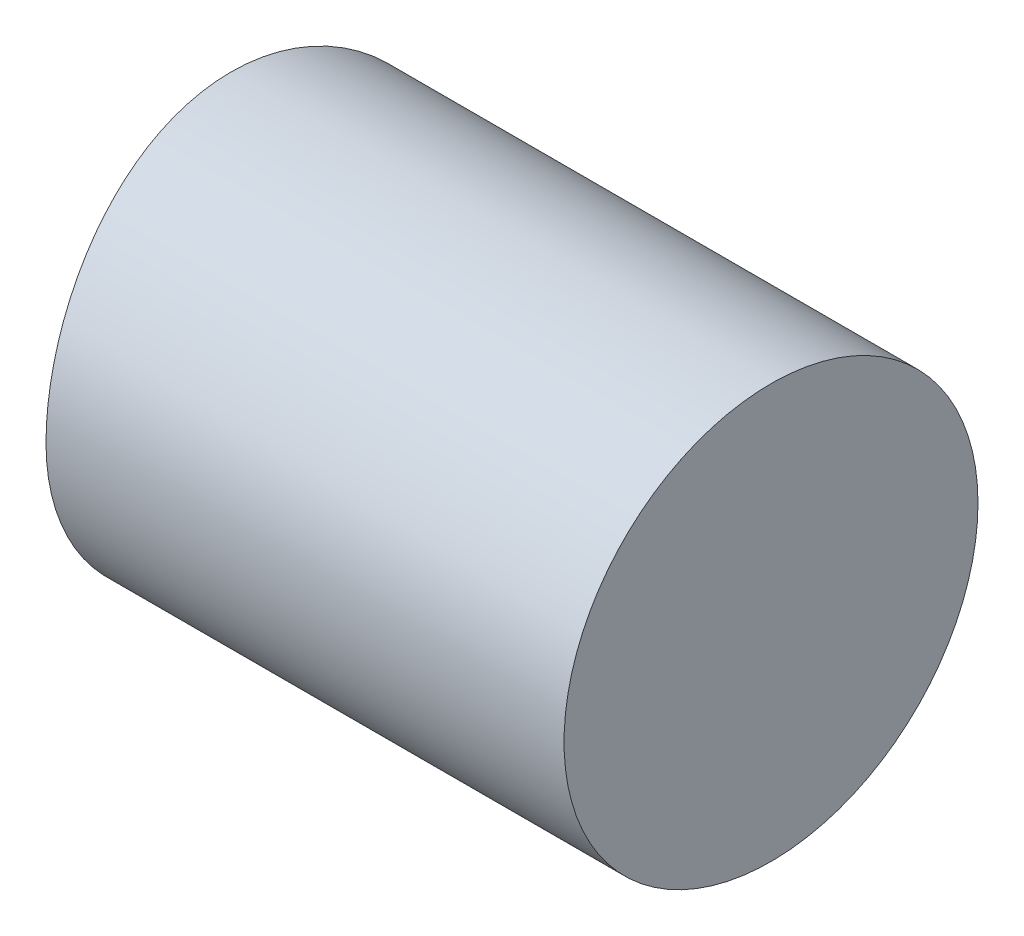
ISO-10303-21;
HEADER;
FILE_DESCRIPTION(('STEP AP214'),'2;1');
FILE_NAME('part.step','',(''),(''),'','','');
FILE_SCHEMA(('AUTOMOTIVE_DESIGN { 1 0 10303 214 1 1 1 1 }'));
ENDSEC;
DATA;
#1=APPLICATION_CONTEXT('core data for automotive mechanical design processes');
#2=APPLICATION_PROTOCOL_DEFINITION('international standard','automotive_design',2000,#1);
#3=PRODUCT_CONTEXT('',#1,'mechanical');
#4=PRODUCT('Part','Part','',(#3));
#5=PRODUCT_RELATED_PRODUCT_CATEGORY('part','',(#4));
#6=PRODUCT_DEFINITION_FORMATION('','',#4);
#7=PRODUCT_DEFINITION_CONTEXT('part definition',#1,'design');
#8=PRODUCT_DEFINITION('design','',#6,#7);
#9=PRODUCT_DEFINITION_SHAPE('','',#8);
#10=(LENGTH_UNIT() NAMED_UNIT(*) SI_UNIT(.MILLI.,.METRE.));
#11=(NAMED_UNIT(*) PLANE_ANGLE_UNIT() SI_UNIT($,.RADIAN.));
#12=(NAMED_UNIT(*) SI_UNIT($,.STERADIAN.) SOLID_ANGLE_UNIT());
#13=UNCERTAINTY_MEASURE_WITH_UNIT(LENGTH_MEASURE(1.E-05),#10,'distance_accuracy_value','');
#14=(GEOMETRIC_REPRESENTATION_CONTEXT(3) GLOBAL_UNCERTAINTY_ASSIGNED_CONTEXT((#13)) GLOBAL_UNIT_ASSIGNED_CONTEXT((#10,
#11,#12)) REPRESENTATION_CONTEXT('',''));
#15=CARTESIAN_POINT('',(0.,0.,0.));
#16=DIRECTION('',(0.,0.,1.));
#17=DIRECTION('',(1.,0.,0.));
#18=AXIS2_PLACEMENT_3D('',#15,#16,#17);
#19=CARTESIAN_POINT('',(7.62,0.,0.));
#20=DIRECTION('',(-1.,0.,0.));
#21=DIRECTION('',(0.,0.,1.));
#22=AXIS2_PLACEMENT_3D('',#19,#20,#21);
#23=CYLINDRICAL_SURFACE('',#22,2.921);
#24=DIRECTION('',(-1.,0.,0.));
#25=VECTOR('',#24,1.);
#26=CARTESIAN_POINT('',(7.62,-1.96747553987337,-2.159));
#27=LINE('',#26,#25);
#28=CARTESIAN_POINT('',(4.37278998770607,-1.96747553987337,-2.159));
#29=VERTEX_POINT('',#28);
#30=CARTESIAN_POINT('',(2.84878998770607,-1.96747553987337,-2.159));
#31=VERTEX_POINT('',#30);
#32=EDGE_CURVE('E79',#29,#31,#27,.T.);
#33=ORIENTED_EDGE('',*,*,#32,.F.);
#34=CARTESIAN_POINT('',(4.37278998770607,0.,0.));
#35=DIRECTION('',(1.,0.,0.));
#36=DIRECTION('',(0.,0.,-1.));
#37=AXIS2_PLACEMENT_3D('',#34,#35,#36);
#38=CIRCLE('',#37,2.921);
#39=CARTESIAN_POINT('',(4.37278998770607,1.96747553987337,-2.159));
#40=VERTEX_POINT('',#39);
#41=EDGE_CURVE('E88',#40,#29,#38,.F.);
#42=ORIENTED_EDGE('',*,*,#41,.F.);
#43=DIRECTION('',(-1.,0.,0.));
#44=VECTOR('',#43,1.);
#45=CARTESIAN_POINT('',(7.62,1.96747553987337,-2.159));
#46=LINE('',#45,#44);
#47=CARTESIAN_POINT('',(2.84878998770607,1.96747553987337,-2.159));
#48=VERTEX_POINT('',#47);
#49=EDGE_CURVE('E76',#40,#48,#46,.T.);
#50=ORIENTED_EDGE('',*,*,#49,.T.);
#51=CARTESIAN_POINT('',(2.84878998770607,0.,0.));
#52=DIRECTION('',(-1.,0.,0.));
#53=DIRECTION('',(0.,0.,1.));
#54=AXIS2_PLACEMENT_3D('',#51,#52,#53);
#55=CIRCLE('',#54,2.921);
#56=EDGE_CURVE('E84',#31,#48,#55,.F.);
#57=ORIENTED_EDGE('',*,*,#56,.F.);
#58=EDGE_LOOP('',(#33,#42,#50,#57));
#59=FACE_BOUND('',#58,.T.);
#60=CARTESIAN_POINT('',(7.62,0.,0.));
#61=DIRECTION('',(1.,0.,0.));
#62=DIRECTION('',(0.,0.,-1.));
#63=AXIS2_PLACEMENT_3D('',#60,#61,#62);
#64=CIRCLE('',#63,2.921);
#65=CARTESIAN_POINT('',(7.62,0.,-2.921));
#66=VERTEX_POINT('',#65);
#67=EDGE_CURVE('E11',#66,#66,#64,.T.);
#68=ORIENTED_EDGE('',*,*,#67,.F.);
#69=EDGE_LOOP('',(#68));
#70=FACE_BOUND('',#69,.T.);
#71=CARTESIAN_POINT('',(0.30878998770607,0.,2.921));
#72=CARTESIAN_POINT('',(0.30879676864344,0.0812160378190927,2.92100886662449));
#73=CARTESIAN_POINT('',(0.308081900042507,0.16242720032541,2.91761288398569));
#74=CARTESIAN_POINT('',(0.30525909323144,0.324251713831041,2.90407996585594));
#75=CARTESIAN_POINT('',(0.303151328778488,0.404865138127163,2.89394387116117));
#76=CARTESIAN_POINT('',(0.297597258771401,0.56480219375891,2.86702039546376));
#77=CARTESIAN_POINT('',(0.294153040078985,0.644127636055075,2.85024338337848));
#78=CARTESIAN_POINT('',(0.286027408790626,0.801032154030625,2.81018744662001));
#79=CARTESIAN_POINT('',(0.281345991122641,0.878611222549131,2.78690849529134));
#80=CARTESIAN_POINT('',(0.265625843362018,1.10793308032961,2.70755082826436));
#81=CARTESIAN_POINT('',(0.252906592972619,1.25638528892573,2.64193012996667));
#82=CARTESIAN_POINT('',(0.224372282272376,1.54010198817455,2.48726307324698));
#83=CARTESIAN_POINT('',(0.208556987945154,1.67536548079159,2.39821494387316));
#84=CARTESIAN_POINT('',(0.175308680909168,1.93092568228188,2.19783031418311));
#85=CARTESIAN_POINT('',(0.157857316834154,2.05100505822462,2.08621921661153));
#86=CARTESIAN_POINT('',(0.123429628940921,2.27091136116152,1.84442989905821));
#87=CARTESIAN_POINT('',(0.106453486501167,2.37073064391869,1.71424470240582));
#88=CARTESIAN_POINT('',(0.0747145463159705,2.54823726817743,1.43737736629013));
#89=CARTESIAN_POINT('',(0.0599766584755791,2.62568312245552,1.29053744415231));
#90=CARTESIAN_POINT('',(0.0346742534373677,2.75463481950581,0.985674971415867));
#91=CARTESIAN_POINT('',(0.0241047470789136,2.80617169332369,0.827666057939512));
#92=CARTESIAN_POINT('',(0.0109290123890702,2.86952303895681,0.557361497159153));
#93=CARTESIAN_POINT('',(0.00685250227473133,2.88879586872234,0.446827909056994));
#94=CARTESIAN_POINT('',(0.0013866360392412,2.91453677384535,0.224211761688896));
#95=CARTESIAN_POINT('',(-2.7302239877109E-06,2.92100489753159,0.112129208270818));
#96=CARTESIAN_POINT('',(3.94704773682593E-06,2.92099291970511,-0.162103673271427));
#97=CARTESIAN_POINT('',(0.00291738858105474,2.90745716542013,-0.324304855614977));
#98=CARTESIAN_POINT('',(0.0142402515412979,2.85371398749805,-0.644132561008618));
#99=CARTESIAN_POINT('',(0.0226551646505182,2.8134799124449,-0.801754348433356));
#100=CARTESIAN_POINT('',(0.0439863557879903,2.70765291776557,-1.10771058171859));
#101=CARTESIAN_POINT('',(0.0568974738808856,2.64208905771577,-1.2560554447507));
#102=CARTESIAN_POINT('',(0.085760595023545,2.48753912838168,-1.53963385689425));
#103=CARTESIAN_POINT('',(0.101712385823294,2.39855469377369,-1.67486832016589));
#104=CARTESIAN_POINT('',(0.13513489136594,2.19822537498501,-1.93048630379785));
#105=CARTESIAN_POINT('',(0.152623593179758,2.08658768514872,-2.05063802684372));
#106=CARTESIAN_POINT('',(0.186992409549782,1.84474323661803,-2.27065821195702));
#107=CARTESIAN_POINT('',(0.203872454219257,1.71453435400956,-2.37052435087096));
#108=CARTESIAN_POINT('',(0.235319746320877,1.43768519943307,-2.54806066551389));
#109=CARTESIAN_POINT('',(0.249862644944469,1.29089607848832,-2.62550316107719));
#110=CARTESIAN_POINT('',(0.274783112450199,0.986059674666692,-2.75450023569416));
#111=CARTESIAN_POINT('',(0.28516340005638,0.828019819672436,-2.806071717413));
#112=CARTESIAN_POINT('',(0.298086870859191,0.557575012051309,-2.86948453916963));
#113=CARTESIAN_POINT('',(0.302078702796426,0.446929583004398,-2.88877961276255));
#114=CARTESIAN_POINT('',(0.307439529468937,0.224207473873553,-2.91454176459838));
#115=CARTESIAN_POINT('',(0.308811169134308,0.112132352182438,-2.92102177912355));
#116=CARTESIAN_POINT('',(0.30878998770607,0.,-2.921));
#117=B_SPLINE_CURVE_WITH_KNOTS('',3,(#71,#72,#73,#74,#75,#76,#77,#78,#79,#80,#81,#82,#83,#84,
#85,#86,#87,#88,#89,#90,#91,#92,#93,#94,#95,#96,#97,#98,#99,#100,#101,#102,#103,#104,#105,#106,
#107,#108,#109,#110,#111,#112,#113,#114,#115,#116),.UNSPECIFIED.,.F.,.F.,(4,2,2,2,2,2,2,2,2,2,2,
2,2,2,2,2,2,2,2,2,2,2,4),(0.,0.243565480899993,0.48710058388992,0.730256929380532,
0.973414271734441,1.45935383262573,1.9453301377482,2.43762164254331,2.93009854756571,
3.42770776116887,3.92471956251162,4.26082227404672,4.59692371702806,5.08282100765648,
5.56920407307293,6.05503078501508,6.54082359689613,7.03334909908791,7.52593097471377,
8.02335174723276,8.52044710835855,8.85687985110113,9.19297280493232),.UNSPECIFIED.);
#118=CARTESIAN_POINT('',(0.30878998770607,0.,2.921));
#119=VERTEX_POINT('',#118);
#120=CARTESIAN_POINT('',(0.30878998770607,0.,-2.921));
#121=VERTEX_POINT('',#120);
#122=EDGE_CURVE('E60',#119,#121,#117,.T.);
#123=ORIENTED_EDGE('',*,*,#122,.F.);
#124=CARTESIAN_POINT('',(0.30878998770607,0.,0.));
#125=DIRECTION('',(1.,0.,0.));
#126=DIRECTION('',(0.,1.,0.));
#127=AXIS2_PLACEMENT_3D('',#124,#125,#126);
#128=CIRCLE('',#127,2.921);
#129=EDGE_CURVE('E108',#121,#119,#128,.F.);
#130=ORIENTED_EDGE('',*,*,#129,.F.);
#131=EDGE_LOOP('',(#123,#130));
#132=FACE_BOUND('',#131,.T.);
#133=ADVANCED_FACE('F39',(#59,#70,#132),#23,.T.);
#134=CARTESIAN_POINT('',(7.62,0.,0.));
#135=DIRECTION('',(1.,0.,0.));
#136=DIRECTION('',(0.,0.,-1.));
#137=AXIS2_PLACEMENT_3D('',#134,#135,#136);
#138=PLANE('',#137);
#139=ORIENTED_EDGE('',*,*,#67,.T.);
#140=EDGE_LOOP('',(#139));
#141=FACE_BOUND('',#140,.T.);
#142=ADVANCED_FACE('F115',(#141),#138,.T.);
#143=CARTESIAN_POINT('',(0.30878998770607,0.,-2.922));
#144=DIRECTION('',(1.,0.,0.));
#145=DIRECTION('',(0.,1.,0.));
#146=AXIS2_PLACEMENT_3D('',#143,#144,#145);
#147=PLANE('',#146);
#148=ORIENTED_EDGE('',*,*,#129,.T.);
#149=DIRECTION('',(0.,0.,1.));
#150=VECTOR('',#149,1.);
#151=CARTESIAN_POINT('',(0.30878998770607,0.,-2.922));
#152=LINE('',#151,#150);
#153=EDGE_CURVE('E47',#121,#119,#152,.T.);
#154=ORIENTED_EDGE('',*,*,#153,.F.);
#155=EDGE_LOOP('',(#148,#154));
#156=FACE_BOUND('',#155,.T.);
#157=ADVANCED_FACE('F114',(#156),#147,.F.);
#158=CARTESIAN_POINT('',(-13.6612100122939,0.,-2.922));
#159=DIRECTION('',(0.,0.,1.));
#160=DIRECTION('',(1.,0.,0.));
#161=AXIS2_PLACEMENT_3D('',#158,#159,#160);
#162=CYLINDRICAL_SURFACE('',#161,13.97);
#163=ORIENTED_EDGE('',*,*,#122,.T.);
#164=ORIENTED_EDGE('',*,*,#153,.T.);
#165=EDGE_LOOP('',(#163,#164));
#166=FACE_BOUND('',#165,.T.);
#167=ADVANCED_FACE('F109',(#166),#162,.F.);
#168=CARTESIAN_POINT('',(2.84878998770607,-2.922,-2.159));
#169=DIRECTION('',(0.,0.,1.));
#170=DIRECTION('',(1.,0.,0.));
#171=AXIS2_PLACEMENT_3D('',#168,#169,#170);
#172=PLANE('',#171);
#173=ORIENTED_EDGE('',*,*,#32,.T.);
#174=DIRECTION('',(0.,1.,0.));
#175=VECTOR('',#174,1.);
#176=CARTESIAN_POINT('',(2.84878998770607,-2.922,-2.159));
#177=LINE('',#176,#175);
#178=EDGE_CURVE('E53',#31,#48,#177,.T.);
#179=ORIENTED_EDGE('',*,*,#178,.T.);
#180=ORIENTED_EDGE('',*,*,#49,.F.);
#181=DIRECTION('',(0.,1.,0.));
#182=VECTOR('',#181,1.);
#183=CARTESIAN_POINT('',(4.37278998770607,-2.922,-2.159));
#184=LINE('',#183,#182);
#185=EDGE_CURVE('E82',#29,#40,#184,.T.);
#186=ORIENTED_EDGE('',*,*,#185,.F.);
#187=EDGE_LOOP('',(#173,#179,#180,#186));
#188=FACE_BOUND('',#187,.T.);
#189=ADVANCED_FACE('F73',(#188),#172,.F.);
#190=CARTESIAN_POINT('',(4.37278998770607,-2.922,-2.921));
#191=DIRECTION('',(1.,0.,0.));
#192=DIRECTION('',(0.,0.,-1.));
#193=AXIS2_PLACEMENT_3D('',#190,#191,#192);
#194=PLANE('',#193);
#195=ORIENTED_EDGE('',*,*,#41,.T.);
#196=ORIENTED_EDGE('',*,*,#185,.T.);
#197=EDGE_LOOP('',(#195,#196));
#198=FACE_BOUND('',#197,.T.);
#199=ADVANCED_FACE('F141',(#198),#194,.F.);
#200=CARTESIAN_POINT('',(2.84878998770607,-2.922,-2.921));
#201=DIRECTION('',(-1.,0.,0.));
#202=DIRECTION('',(0.,0.,1.));
#203=AXIS2_PLACEMENT_3D('',#200,#201,#202);
#204=PLANE('',#203);
#205=ORIENTED_EDGE('',*,*,#56,.T.);
#206=ORIENTED_EDGE('',*,*,#178,.F.);
#207=EDGE_LOOP('',(#205,#206));
#208=FACE_BOUND('',#207,.T.);
#209=ADVANCED_FACE('F85',(#208),#204,.F.);
#210=CLOSED_SHELL('',(#133,#142,#157,#167,#189,#199,#209));
#211=MANIFOLD_SOLID_BREP('B2',#210);
#212=ADVANCED_BREP_SHAPE_REPRESENTATION('',(#18,#211),#14);
#213=SHAPE_DEFINITION_REPRESENTATION(#9,#212);
ENDSEC;
END-ISO-10303-21;
